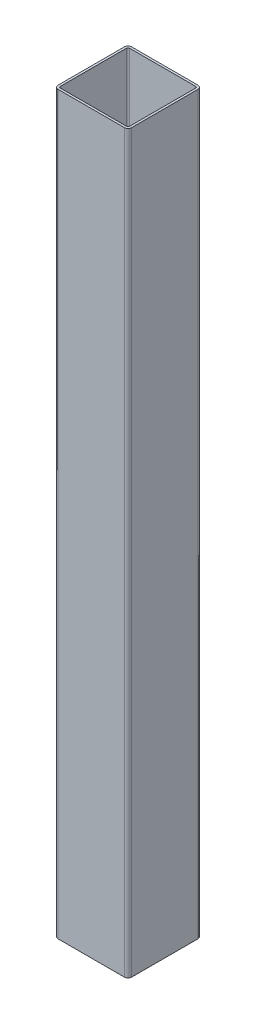
ISO-10303-21;
HEADER;
FILE_DESCRIPTION(('STEP AP214'),'2;1');
FILE_NAME('part.step','',(''),(''),'','','');
FILE_SCHEMA(('AUTOMOTIVE_DESIGN { 1 0 10303 214 1 1 1 1 }'));
ENDSEC;
DATA;
#1=APPLICATION_CONTEXT('core data for automotive mechanical design processes');
#2=APPLICATION_PROTOCOL_DEFINITION('international standard','automotive_design',2000,#1);
#3=PRODUCT_CONTEXT('',#1,'mechanical');
#4=PRODUCT('Part','Part','',(#3));
#5=PRODUCT_RELATED_PRODUCT_CATEGORY('part','',(#4));
#6=PRODUCT_DEFINITION_FORMATION('','',#4);
#7=PRODUCT_DEFINITION_CONTEXT('part definition',#1,'design');
#8=PRODUCT_DEFINITION('design','',#6,#7);
#9=PRODUCT_DEFINITION_SHAPE('','',#8);
#10=(LENGTH_UNIT() NAMED_UNIT(*) SI_UNIT(.MILLI.,.METRE.));
#11=(NAMED_UNIT(*) PLANE_ANGLE_UNIT() SI_UNIT($,.RADIAN.));
#12=(NAMED_UNIT(*) SI_UNIT($,.STERADIAN.) SOLID_ANGLE_UNIT());
#13=UNCERTAINTY_MEASURE_WITH_UNIT(LENGTH_MEASURE(1.E-05),#10,'distance_accuracy_value','');
#14=(GEOMETRIC_REPRESENTATION_CONTEXT(3) GLOBAL_UNCERTAINTY_ASSIGNED_CONTEXT((#13)) GLOBAL_UNIT_ASSIGNED_CONTEXT((#10,
#11,#12)) REPRESENTATION_CONTEXT('',''));
#15=CARTESIAN_POINT('',(0.,0.,0.));
#16=DIRECTION('',(0.,0.,1.));
#17=DIRECTION('',(1.,0.,0.));
#18=AXIS2_PLACEMENT_3D('',#15,#16,#17);
#19=CARTESIAN_POINT('',(45.,1000.,45.));
#20=DIRECTION('',(0.,1.,0.));
#21=DIRECTION('',(0.,0.,1.));
#22=AXIS2_PLACEMENT_3D('',#19,#20,#21);
#23=PLANE('',#22);
#24=CARTESIAN_POINT('',(45.,1000.,45.));
#25=DIRECTION('',(0.,1.,0.));
#26=DIRECTION('',(0.,0.,1.));
#27=AXIS2_PLACEMENT_3D('',#24,#25,#26);
#28=CIRCLE('',#27,5.);
#29=CARTESIAN_POINT('',(45.,1000.,50.));
#30=VERTEX_POINT('',#29);
#31=CARTESIAN_POINT('',(50.,1000.,45.));
#32=VERTEX_POINT('',#31);
#33=EDGE_CURVE('E262',#30,#32,#28,.T.);
#34=ORIENTED_EDGE('',*,*,#33,.T.);
#35=DIRECTION('',(0.,0.,-1.));
#36=VECTOR('',#35,1.);
#37=CARTESIAN_POINT('',(50.,1000.,-45.));
#38=LINE('',#37,#36);
#39=CARTESIAN_POINT('',(50.,1000.,-45.));
#40=VERTEX_POINT('',#39);
#41=EDGE_CURVE('E265',#32,#40,#38,.T.);
#42=ORIENTED_EDGE('',*,*,#41,.T.);
#43=CARTESIAN_POINT('',(45.,1000.,-45.));
#44=DIRECTION('',(0.,1.,0.));
#45=DIRECTION('',(0.,0.,-1.));
#46=AXIS2_PLACEMENT_3D('',#43,#44,#45);
#47=CIRCLE('',#46,5.);
#48=CARTESIAN_POINT('',(45.,1000.,-50.));
#49=VERTEX_POINT('',#48);
#50=EDGE_CURVE('E268',#40,#49,#47,.T.);
#51=ORIENTED_EDGE('',*,*,#50,.T.);
#52=DIRECTION('',(-1.,0.,0.));
#53=VECTOR('',#52,1.);
#54=CARTESIAN_POINT('',(-45.,1000.,-50.));
#55=LINE('',#54,#53);
#56=CARTESIAN_POINT('',(-45.,1000.,-50.));
#57=VERTEX_POINT('',#56);
#58=EDGE_CURVE('E270',#49,#57,#55,.T.);
#59=ORIENTED_EDGE('',*,*,#58,.T.);
#60=CARTESIAN_POINT('',(-45.,1000.,-45.));
#61=DIRECTION('',(0.,1.,0.));
#62=DIRECTION('',(0.,0.,1.));
#63=AXIS2_PLACEMENT_3D('',#60,#61,#62);
#64=CIRCLE('',#63,5.);
#65=CARTESIAN_POINT('',(-50.,1000.,-45.));
#66=VERTEX_POINT('',#65);
#67=EDGE_CURVE('E272',#57,#66,#64,.T.);
#68=ORIENTED_EDGE('',*,*,#67,.T.);
#69=DIRECTION('',(0.,0.,1.));
#70=VECTOR('',#69,1.);
#71=CARTESIAN_POINT('',(-50.,1000.,-45.));
#72=LINE('',#71,#70);
#73=CARTESIAN_POINT('',(-50.,1000.,45.));
#74=VERTEX_POINT('',#73);
#75=EDGE_CURVE('E274',#66,#74,#72,.T.);
#76=ORIENTED_EDGE('',*,*,#75,.T.);
#77=CARTESIAN_POINT('',(-45.,1000.,45.));
#78=DIRECTION('',(0.,1.,0.));
#79=DIRECTION('',(0.,0.,1.));
#80=AXIS2_PLACEMENT_3D('',#77,#78,#79);
#81=CIRCLE('',#80,5.);
#82=CARTESIAN_POINT('',(-45.,1000.,50.));
#83=VERTEX_POINT('',#82);
#84=EDGE_CURVE('E276',#74,#83,#81,.T.);
#85=ORIENTED_EDGE('',*,*,#84,.T.);
#86=DIRECTION('',(1.,0.,0.));
#87=VECTOR('',#86,1.);
#88=CARTESIAN_POINT('',(-45.,1000.,50.));
#89=LINE('',#88,#87);
#90=EDGE_CURVE('E278',#83,#30,#89,.T.);
#91=ORIENTED_EDGE('',*,*,#90,.T.);
#92=EDGE_LOOP('',(#34,#42,#51,#59,#68,#76,#85,#91));
#93=FACE_BOUND('',#92,.T.);
#94=DIRECTION('',(0.,0.,-1.));
#95=VECTOR('',#94,1.);
#96=CARTESIAN_POINT('',(47.,1000.,-45.));
#97=LINE('',#96,#95);
#98=CARTESIAN_POINT('',(47.,1000.,45.));
#99=VERTEX_POINT('',#98);
#100=CARTESIAN_POINT('',(47.,1000.,-45.));
#101=VERTEX_POINT('',#100);
#102=EDGE_CURVE('E205',#99,#101,#97,.T.);
#103=ORIENTED_EDGE('',*,*,#102,.F.);
#104=CARTESIAN_POINT('',(45.,1000.,45.));
#105=DIRECTION('',(0.,1.,0.));
#106=DIRECTION('',(1.,0.,0.));
#107=AXIS2_PLACEMENT_3D('',#104,#105,#106);
#108=CIRCLE('',#107,2.);
#109=CARTESIAN_POINT('',(45.,1000.,47.));
#110=VERTEX_POINT('',#109);
#111=EDGE_CURVE('E197',#110,#99,#108,.T.);
#112=ORIENTED_EDGE('',*,*,#111,.F.);
#113=DIRECTION('',(1.,0.,0.));
#114=VECTOR('',#113,1.);
#115=CARTESIAN_POINT('',(-45.,1000.,47.));
#116=LINE('',#115,#114);
#117=CARTESIAN_POINT('',(-45.,1000.,47.));
#118=VERTEX_POINT('',#117);
#119=EDGE_CURVE('E230',#118,#110,#116,.T.);
#120=ORIENTED_EDGE('',*,*,#119,.F.);
#121=CARTESIAN_POINT('',(-45.,1000.,45.));
#122=DIRECTION('',(0.,1.,0.));
#123=DIRECTION('',(1.,0.,0.));
#124=AXIS2_PLACEMENT_3D('',#121,#122,#123);
#125=CIRCLE('',#124,2.);
#126=CARTESIAN_POINT('',(-47.,1000.,45.));
#127=VERTEX_POINT('',#126);
#128=EDGE_CURVE('E228',#127,#118,#125,.T.);
#129=ORIENTED_EDGE('',*,*,#128,.F.);
#130=DIRECTION('',(0.,0.,1.));
#131=VECTOR('',#130,1.);
#132=CARTESIAN_POINT('',(-47.,1000.,-45.));
#133=LINE('',#132,#131);
#134=CARTESIAN_POINT('',(-47.,1000.,-45.));
#135=VERTEX_POINT('',#134);
#136=EDGE_CURVE('E226',#135,#127,#133,.T.);
#137=ORIENTED_EDGE('',*,*,#136,.F.);
#138=CARTESIAN_POINT('',(-45.,1000.,-45.));
#139=DIRECTION('',(0.,1.,0.));
#140=DIRECTION('',(1.,0.,0.));
#141=AXIS2_PLACEMENT_3D('',#138,#139,#140);
#142=CIRCLE('',#141,2.);
#143=CARTESIAN_POINT('',(-45.,1000.,-47.));
#144=VERTEX_POINT('',#143);
#145=EDGE_CURVE('E224',#144,#135,#142,.T.);
#146=ORIENTED_EDGE('',*,*,#145,.F.);
#147=DIRECTION('',(-1.,0.,0.));
#148=VECTOR('',#147,1.);
#149=CARTESIAN_POINT('',(-45.,1000.,-47.));
#150=LINE('',#149,#148);
#151=CARTESIAN_POINT('',(45.,1000.,-47.));
#152=VERTEX_POINT('',#151);
#153=EDGE_CURVE('E220',#152,#144,#150,.T.);
#154=ORIENTED_EDGE('',*,*,#153,.F.);
#155=CARTESIAN_POINT('',(45.,1000.,-45.));
#156=DIRECTION('',(0.,1.,0.));
#157=DIRECTION('',(1.,0.,0.));
#158=AXIS2_PLACEMENT_3D('',#155,#156,#157);
#159=CIRCLE('',#158,2.);
#160=EDGE_CURVE('E218',#101,#152,#159,.T.);
#161=ORIENTED_EDGE('',*,*,#160,.F.);
#162=EDGE_LOOP('',(#103,#112,#120,#129,#137,#146,#154,#161));
#163=FACE_BOUND('',#162,.T.);
#164=ADVANCED_FACE('F84',(#93,#163),#23,.T.);
#165=CARTESIAN_POINT('',(45.,0.,45.));
#166=DIRECTION('',(0.,1.,0.));
#167=DIRECTION('',(0.,0.,1.));
#168=AXIS2_PLACEMENT_3D('',#165,#166,#167);
#169=PLANE('',#168);
#170=CARTESIAN_POINT('',(45.,0.,45.));
#171=DIRECTION('',(0.,1.,0.));
#172=DIRECTION('',(0.,0.,1.));
#173=AXIS2_PLACEMENT_3D('',#170,#171,#172);
#174=CIRCLE('',#173,5.);
#175=CARTESIAN_POINT('',(45.,0.,50.));
#176=VERTEX_POINT('',#175);
#177=CARTESIAN_POINT('',(50.,0.,45.));
#178=VERTEX_POINT('',#177);
#179=EDGE_CURVE('E213',#176,#178,#174,.T.);
#180=ORIENTED_EDGE('',*,*,#179,.F.);
#181=DIRECTION('',(1.,0.,0.));
#182=VECTOR('',#181,1.);
#183=CARTESIAN_POINT('',(-45.,0.,50.));
#184=LINE('',#183,#182);
#185=CARTESIAN_POINT('',(-45.,0.,50.));
#186=VERTEX_POINT('',#185);
#187=EDGE_CURVE('E266',#186,#176,#184,.T.);
#188=ORIENTED_EDGE('',*,*,#187,.F.);
#189=CARTESIAN_POINT('',(-45.,0.,45.));
#190=DIRECTION('',(0.,1.,0.));
#191=DIRECTION('',(0.,0.,1.));
#192=AXIS2_PLACEMENT_3D('',#189,#190,#191);
#193=CIRCLE('',#192,5.);
#194=CARTESIAN_POINT('',(-50.,0.,45.));
#195=VERTEX_POINT('',#194);
#196=EDGE_CURVE('E293',#195,#186,#193,.T.);
#197=ORIENTED_EDGE('',*,*,#196,.F.);
#198=DIRECTION('',(0.,0.,1.));
#199=VECTOR('',#198,1.);
#200=CARTESIAN_POINT('',(-50.,0.,-45.));
#201=LINE('',#200,#199);
#202=CARTESIAN_POINT('',(-50.,0.,-45.));
#203=VERTEX_POINT('',#202);
#204=EDGE_CURVE('E291',#203,#195,#201,.T.);
#205=ORIENTED_EDGE('',*,*,#204,.F.);
#206=CARTESIAN_POINT('',(-45.,0.,-45.));
#207=DIRECTION('',(0.,1.,0.));
#208=DIRECTION('',(0.,0.,1.));
#209=AXIS2_PLACEMENT_3D('',#206,#207,#208);
#210=CIRCLE('',#209,5.);
#211=CARTESIAN_POINT('',(-45.,0.,-50.));
#212=VERTEX_POINT('',#211);
#213=EDGE_CURVE('E289',#212,#203,#210,.T.);
#214=ORIENTED_EDGE('',*,*,#213,.F.);
#215=DIRECTION('',(-1.,0.,0.));
#216=VECTOR('',#215,1.);
#217=CARTESIAN_POINT('',(-45.,0.,-50.));
#218=LINE('',#217,#216);
#219=CARTESIAN_POINT('',(45.,0.,-50.));
#220=VERTEX_POINT('',#219);
#221=EDGE_CURVE('E287',#220,#212,#218,.T.);
#222=ORIENTED_EDGE('',*,*,#221,.F.);
#223=CARTESIAN_POINT('',(45.,0.,-45.));
#224=DIRECTION('',(0.,1.,0.));
#225=DIRECTION('',(0.,0.,-1.));
#226=AXIS2_PLACEMENT_3D('',#223,#224,#225);
#227=CIRCLE('',#226,5.);
#228=CARTESIAN_POINT('',(50.,0.,-45.));
#229=VERTEX_POINT('',#228);
#230=EDGE_CURVE('E285',#229,#220,#227,.T.);
#231=ORIENTED_EDGE('',*,*,#230,.F.);
#232=DIRECTION('',(0.,0.,-1.));
#233=VECTOR('',#232,1.);
#234=CARTESIAN_POINT('',(50.,0.,-45.));
#235=LINE('',#234,#233);
#236=EDGE_CURVE('E283',#178,#229,#235,.T.);
#237=ORIENTED_EDGE('',*,*,#236,.F.);
#238=EDGE_LOOP('',(#180,#188,#197,#205,#214,#222,#231,#237));
#239=FACE_BOUND('',#238,.T.);
#240=CARTESIAN_POINT('',(45.,0.,45.));
#241=DIRECTION('',(0.,1.,0.));
#242=DIRECTION('',(1.,0.,0.));
#243=AXIS2_PLACEMENT_3D('',#240,#241,#242);
#244=CIRCLE('',#243,2.);
#245=CARTESIAN_POINT('',(45.,0.,47.));
#246=VERTEX_POINT('',#245);
#247=CARTESIAN_POINT('',(47.,0.,45.));
#248=VERTEX_POINT('',#247);
#249=EDGE_CURVE('E107',#246,#248,#244,.T.);
#250=ORIENTED_EDGE('',*,*,#249,.T.);
#251=DIRECTION('',(0.,0.,-1.));
#252=VECTOR('',#251,1.);
#253=CARTESIAN_POINT('',(47.,0.,-45.));
#254=LINE('',#253,#252);
#255=CARTESIAN_POINT('',(47.,0.,-45.));
#256=VERTEX_POINT('',#255);
#257=EDGE_CURVE('E212',#248,#256,#254,.T.);
#258=ORIENTED_EDGE('',*,*,#257,.T.);
#259=CARTESIAN_POINT('',(45.,0.,-45.));
#260=DIRECTION('',(0.,1.,0.));
#261=DIRECTION('',(1.,0.,0.));
#262=AXIS2_PLACEMENT_3D('',#259,#260,#261);
#263=CIRCLE('',#262,2.);
#264=CARTESIAN_POINT('',(45.,0.,-47.));
#265=VERTEX_POINT('',#264);
#266=EDGE_CURVE('E234',#256,#265,#263,.T.);
#267=ORIENTED_EDGE('',*,*,#266,.T.);
#268=DIRECTION('',(-1.,0.,0.));
#269=VECTOR('',#268,1.);
#270=CARTESIAN_POINT('',(-45.,0.,-47.));
#271=LINE('',#270,#269);
#272=CARTESIAN_POINT('',(-45.,0.,-47.));
#273=VERTEX_POINT('',#272);
#274=EDGE_CURVE('E237',#265,#273,#271,.T.);
#275=ORIENTED_EDGE('',*,*,#274,.T.);
#276=CARTESIAN_POINT('',(-45.,0.,-45.));
#277=DIRECTION('',(0.,1.,0.));
#278=DIRECTION('',(1.,0.,0.));
#279=AXIS2_PLACEMENT_3D('',#276,#277,#278);
#280=CIRCLE('',#279,2.);
#281=CARTESIAN_POINT('',(-47.,0.,-45.));
#282=VERTEX_POINT('',#281);
#283=EDGE_CURVE('E240',#273,#282,#280,.T.);
#284=ORIENTED_EDGE('',*,*,#283,.T.);
#285=DIRECTION('',(0.,0.,1.));
#286=VECTOR('',#285,1.);
#287=CARTESIAN_POINT('',(-47.,0.,-45.));
#288=LINE('',#287,#286);
#289=CARTESIAN_POINT('',(-47.,0.,45.));
#290=VERTEX_POINT('',#289);
#291=EDGE_CURVE('E243',#282,#290,#288,.T.);
#292=ORIENTED_EDGE('',*,*,#291,.T.);
#293=CARTESIAN_POINT('',(-45.,0.,45.));
#294=DIRECTION('',(0.,1.,0.));
#295=DIRECTION('',(1.,0.,0.));
#296=AXIS2_PLACEMENT_3D('',#293,#294,#295);
#297=CIRCLE('',#296,2.);
#298=CARTESIAN_POINT('',(-45.,0.,47.));
#299=VERTEX_POINT('',#298);
#300=EDGE_CURVE('E246',#290,#299,#297,.T.);
#301=ORIENTED_EDGE('',*,*,#300,.T.);
#302=DIRECTION('',(1.,0.,0.));
#303=VECTOR('',#302,1.);
#304=CARTESIAN_POINT('',(-45.,0.,47.));
#305=LINE('',#304,#303);
#306=EDGE_CURVE('E206',#299,#246,#305,.T.);
#307=ORIENTED_EDGE('',*,*,#306,.T.);
#308=EDGE_LOOP('',(#250,#258,#267,#275,#284,#292,#301,#307));
#309=FACE_BOUND('',#308,.T.);
#310=ADVANCED_FACE('F323',(#239,#309),#169,.F.);
#311=CARTESIAN_POINT('',(45.,1000.,45.));
#312=DIRECTION('',(0.,-1.,0.));
#313=DIRECTION('',(0.,0.,-1.));
#314=AXIS2_PLACEMENT_3D('',#311,#312,#313);
#315=CYLINDRICAL_SURFACE('',#314,5.);
#316=ORIENTED_EDGE('',*,*,#179,.T.);
#317=DIRECTION('',(0.,-1.,0.));
#318=VECTOR('',#317,1.);
#319=CARTESIAN_POINT('',(50.,1000.,45.));
#320=LINE('',#319,#318);
#321=EDGE_CURVE('E12',#32,#178,#320,.T.);
#322=ORIENTED_EDGE('',*,*,#321,.F.);
#323=ORIENTED_EDGE('',*,*,#33,.F.);
#324=DIRECTION('',(0.,-1.,0.));
#325=VECTOR('',#324,1.);
#326=CARTESIAN_POINT('',(45.,1000.,50.));
#327=LINE('',#326,#325);
#328=EDGE_CURVE('E280',#30,#176,#327,.T.);
#329=ORIENTED_EDGE('',*,*,#328,.T.);
#330=EDGE_LOOP('',(#316,#322,#323,#329));
#331=FACE_BOUND('',#330,.T.);
#332=ADVANCED_FACE('F86',(#331),#315,.T.);
#333=CARTESIAN_POINT('',(50.,1000.,-45.));
#334=DIRECTION('',(-1.,0.,0.));
#335=DIRECTION('',(0.,0.,1.));
#336=AXIS2_PLACEMENT_3D('',#333,#334,#335);
#337=PLANE('',#336);
#338=ORIENTED_EDGE('',*,*,#236,.T.);
#339=DIRECTION('',(0.,-1.,0.));
#340=VECTOR('',#339,1.);
#341=CARTESIAN_POINT('',(50.,1000.,-45.));
#342=LINE('',#341,#340);
#343=EDGE_CURVE('E92',#40,#229,#342,.T.);
#344=ORIENTED_EDGE('',*,*,#343,.F.);
#345=ORIENTED_EDGE('',*,*,#41,.F.);
#346=ORIENTED_EDGE('',*,*,#321,.T.);
#347=EDGE_LOOP('',(#338,#344,#345,#346));
#348=FACE_BOUND('',#347,.T.);
#349=ADVANCED_FACE('F340',(#348),#337,.F.);
#350=CARTESIAN_POINT('',(45.,1000.,-45.));
#351=DIRECTION('',(0.,-1.,0.));
#352=DIRECTION('',(0.,0.,-1.));
#353=AXIS2_PLACEMENT_3D('',#350,#351,#352);
#354=CYLINDRICAL_SURFACE('',#353,5.);
#355=ORIENTED_EDGE('',*,*,#230,.T.);
#356=DIRECTION('',(0.,-1.,0.));
#357=VECTOR('',#356,1.);
#358=CARTESIAN_POINT('',(45.,1000.,-50.));
#359=LINE('',#358,#357);
#360=EDGE_CURVE('E310',#49,#220,#359,.T.);
#361=ORIENTED_EDGE('',*,*,#360,.F.);
#362=ORIENTED_EDGE('',*,*,#50,.F.);
#363=ORIENTED_EDGE('',*,*,#343,.T.);
#364=EDGE_LOOP('',(#355,#361,#362,#363));
#365=FACE_BOUND('',#364,.T.);
#366=ADVANCED_FACE('F317',(#365),#354,.T.);
#367=CARTESIAN_POINT('',(-45.,1000.,-50.));
#368=DIRECTION('',(0.,0.,1.));
#369=DIRECTION('',(1.,0.,0.));
#370=AXIS2_PLACEMENT_3D('',#367,#368,#369);
#371=PLANE('',#370);
#372=ORIENTED_EDGE('',*,*,#221,.T.);
#373=DIRECTION('',(0.,-1.,0.));
#374=VECTOR('',#373,1.);
#375=CARTESIAN_POINT('',(-45.,1000.,-50.));
#376=LINE('',#375,#374);
#377=EDGE_CURVE('E307',#57,#212,#376,.T.);
#378=ORIENTED_EDGE('',*,*,#377,.F.);
#379=ORIENTED_EDGE('',*,*,#58,.F.);
#380=ORIENTED_EDGE('',*,*,#360,.T.);
#381=EDGE_LOOP('',(#372,#378,#379,#380));
#382=FACE_BOUND('',#381,.T.);
#383=ADVANCED_FACE('F329',(#382),#371,.F.);
#384=CARTESIAN_POINT('',(-45.,1000.,-45.));
#385=DIRECTION('',(0.,-1.,0.));
#386=DIRECTION('',(0.,0.,-1.));
#387=AXIS2_PLACEMENT_3D('',#384,#385,#386);
#388=CYLINDRICAL_SURFACE('',#387,5.);
#389=ORIENTED_EDGE('',*,*,#213,.T.);
#390=DIRECTION('',(0.,-1.,0.));
#391=VECTOR('',#390,1.);
#392=CARTESIAN_POINT('',(-50.,1000.,-45.));
#393=LINE('',#392,#391);
#394=EDGE_CURVE('E304',#66,#203,#393,.T.);
#395=ORIENTED_EDGE('',*,*,#394,.F.);
#396=ORIENTED_EDGE('',*,*,#67,.F.);
#397=ORIENTED_EDGE('',*,*,#377,.T.);
#398=EDGE_LOOP('',(#389,#395,#396,#397));
#399=FACE_BOUND('',#398,.T.);
#400=ADVANCED_FACE('F333',(#399),#388,.T.);
#401=CARTESIAN_POINT('',(-50.,1000.,-45.));
#402=DIRECTION('',(1.,0.,0.));
#403=DIRECTION('',(0.,0.,-1.));
#404=AXIS2_PLACEMENT_3D('',#401,#402,#403);
#405=PLANE('',#404);
#406=ORIENTED_EDGE('',*,*,#204,.T.);
#407=DIRECTION('',(0.,-1.,0.));
#408=VECTOR('',#407,1.);
#409=CARTESIAN_POINT('',(-50.,1000.,45.));
#410=LINE('',#409,#408);
#411=EDGE_CURVE('E301',#74,#195,#410,.T.);
#412=ORIENTED_EDGE('',*,*,#411,.F.);
#413=ORIENTED_EDGE('',*,*,#75,.F.);
#414=ORIENTED_EDGE('',*,*,#394,.T.);
#415=EDGE_LOOP('',(#406,#412,#413,#414));
#416=FACE_BOUND('',#415,.T.);
#417=ADVANCED_FACE('F353',(#416),#405,.F.);
#418=CARTESIAN_POINT('',(-45.,1000.,45.));
#419=DIRECTION('',(0.,-1.,0.));
#420=DIRECTION('',(0.,0.,-1.));
#421=AXIS2_PLACEMENT_3D('',#418,#419,#420);
#422=CYLINDRICAL_SURFACE('',#421,5.);
#423=ORIENTED_EDGE('',*,*,#196,.T.);
#424=DIRECTION('',(0.,-1.,0.));
#425=VECTOR('',#424,1.);
#426=CARTESIAN_POINT('',(-45.,1000.,50.));
#427=LINE('',#426,#425);
#428=EDGE_CURVE('E298',#83,#186,#427,.T.);
#429=ORIENTED_EDGE('',*,*,#428,.F.);
#430=ORIENTED_EDGE('',*,*,#84,.F.);
#431=ORIENTED_EDGE('',*,*,#411,.T.);
#432=EDGE_LOOP('',(#423,#429,#430,#431));
#433=FACE_BOUND('',#432,.T.);
#434=ADVANCED_FACE('F351',(#433),#422,.T.);
#435=CARTESIAN_POINT('',(-45.,1000.,50.));
#436=DIRECTION('',(0.,0.,-1.));
#437=DIRECTION('',(-1.,0.,0.));
#438=AXIS2_PLACEMENT_3D('',#435,#436,#437);
#439=PLANE('',#438);
#440=ORIENTED_EDGE('',*,*,#187,.T.);
#441=ORIENTED_EDGE('',*,*,#328,.F.);
#442=ORIENTED_EDGE('',*,*,#90,.F.);
#443=ORIENTED_EDGE('',*,*,#428,.T.);
#444=EDGE_LOOP('',(#440,#441,#442,#443));
#445=FACE_BOUND('',#444,.T.);
#446=ADVANCED_FACE('F346',(#445),#439,.F.);
#447=CARTESIAN_POINT('',(45.,1000.,45.));
#448=DIRECTION('',(0.,-1.,0.));
#449=DIRECTION('',(0.,0.,-1.));
#450=AXIS2_PLACEMENT_3D('',#447,#448,#449);
#451=CYLINDRICAL_SURFACE('',#450,2.);
#452=ORIENTED_EDGE('',*,*,#249,.F.);
#453=DIRECTION('',(0.,-1.,0.));
#454=VECTOR('',#453,1.);
#455=CARTESIAN_POINT('',(45.,1000.,47.));
#456=LINE('',#455,#454);
#457=EDGE_CURVE('E201',#110,#246,#456,.T.);
#458=ORIENTED_EDGE('',*,*,#457,.F.);
#459=ORIENTED_EDGE('',*,*,#111,.T.);
#460=DIRECTION('',(0.,-1.,0.));
#461=VECTOR('',#460,1.);
#462=CARTESIAN_POINT('',(47.,1000.,45.));
#463=LINE('',#462,#461);
#464=EDGE_CURVE('E200',#99,#248,#463,.T.);
#465=ORIENTED_EDGE('',*,*,#464,.T.);
#466=EDGE_LOOP('',(#452,#458,#459,#465));
#467=FACE_BOUND('',#466,.T.);
#468=ADVANCED_FACE('F199',(#467),#451,.F.);
#469=CARTESIAN_POINT('',(47.,1000.,-45.));
#470=DIRECTION('',(-1.,0.,0.));
#471=DIRECTION('',(0.,0.,1.));
#472=AXIS2_PLACEMENT_3D('',#469,#470,#471);
#473=PLANE('',#472);
#474=ORIENTED_EDGE('',*,*,#257,.F.);
#475=ORIENTED_EDGE('',*,*,#464,.F.);
#476=ORIENTED_EDGE('',*,*,#102,.T.);
#477=DIRECTION('',(0.,-1.,0.));
#478=VECTOR('',#477,1.);
#479=CARTESIAN_POINT('',(47.,1000.,-45.));
#480=LINE('',#479,#478);
#481=EDGE_CURVE('E214',#101,#256,#480,.T.);
#482=ORIENTED_EDGE('',*,*,#481,.T.);
#483=EDGE_LOOP('',(#474,#475,#476,#482));
#484=FACE_BOUND('',#483,.T.);
#485=ADVANCED_FACE('F209',(#484),#473,.T.);
#486=CARTESIAN_POINT('',(45.,1000.,-45.));
#487=DIRECTION('',(0.,-1.,0.));
#488=DIRECTION('',(0.,0.,-1.));
#489=AXIS2_PLACEMENT_3D('',#486,#487,#488);
#490=CYLINDRICAL_SURFACE('',#489,2.);
#491=ORIENTED_EDGE('',*,*,#266,.F.);
#492=ORIENTED_EDGE('',*,*,#481,.F.);
#493=ORIENTED_EDGE('',*,*,#160,.T.);
#494=DIRECTION('',(0.,-1.,0.));
#495=VECTOR('',#494,1.);
#496=CARTESIAN_POINT('',(45.,1000.,-47.));
#497=LINE('',#496,#495);
#498=EDGE_CURVE('E259',#152,#265,#497,.T.);
#499=ORIENTED_EDGE('',*,*,#498,.T.);
#500=EDGE_LOOP('',(#491,#492,#493,#499));
#501=FACE_BOUND('',#500,.T.);
#502=ADVANCED_FACE('F378',(#501),#490,.F.);
#503=CARTESIAN_POINT('',(-45.,1000.,-47.));
#504=DIRECTION('',(0.,0.,1.));
#505=DIRECTION('',(1.,0.,0.));
#506=AXIS2_PLACEMENT_3D('',#503,#504,#505);
#507=PLANE('',#506);
#508=ORIENTED_EDGE('',*,*,#274,.F.);
#509=ORIENTED_EDGE('',*,*,#498,.F.);
#510=ORIENTED_EDGE('',*,*,#153,.T.);
#511=DIRECTION('',(0.,-1.,0.));
#512=VECTOR('',#511,1.);
#513=CARTESIAN_POINT('',(-45.,1000.,-47.));
#514=LINE('',#513,#512);
#515=EDGE_CURVE('E257',#144,#273,#514,.T.);
#516=ORIENTED_EDGE('',*,*,#515,.T.);
#517=EDGE_LOOP('',(#508,#509,#510,#516));
#518=FACE_BOUND('',#517,.T.);
#519=ADVANCED_FACE('F382',(#518),#507,.T.);
#520=CARTESIAN_POINT('',(-45.,1000.,-45.));
#521=DIRECTION('',(0.,-1.,0.));
#522=DIRECTION('',(0.,0.,-1.));
#523=AXIS2_PLACEMENT_3D('',#520,#521,#522);
#524=CYLINDRICAL_SURFACE('',#523,2.);
#525=ORIENTED_EDGE('',*,*,#283,.F.);
#526=ORIENTED_EDGE('',*,*,#515,.F.);
#527=ORIENTED_EDGE('',*,*,#145,.T.);
#528=DIRECTION('',(0.,-1.,0.));
#529=VECTOR('',#528,1.);
#530=CARTESIAN_POINT('',(-47.,1000.,-45.));
#531=LINE('',#530,#529);
#532=EDGE_CURVE('E255',#135,#282,#531,.T.);
#533=ORIENTED_EDGE('',*,*,#532,.T.);
#534=EDGE_LOOP('',(#525,#526,#527,#533));
#535=FACE_BOUND('',#534,.T.);
#536=ADVANCED_FACE('F388',(#535),#524,.F.);
#537=CARTESIAN_POINT('',(-47.,1000.,-45.));
#538=DIRECTION('',(1.,0.,0.));
#539=DIRECTION('',(0.,0.,-1.));
#540=AXIS2_PLACEMENT_3D('',#537,#538,#539);
#541=PLANE('',#540);
#542=ORIENTED_EDGE('',*,*,#291,.F.);
#543=ORIENTED_EDGE('',*,*,#532,.F.);
#544=ORIENTED_EDGE('',*,*,#136,.T.);
#545=DIRECTION('',(0.,-1.,0.));
#546=VECTOR('',#545,1.);
#547=CARTESIAN_POINT('',(-47.,1000.,45.));
#548=LINE('',#547,#546);
#549=EDGE_CURVE('E253',#127,#290,#548,.T.);
#550=ORIENTED_EDGE('',*,*,#549,.T.);
#551=EDGE_LOOP('',(#542,#543,#544,#550));
#552=FACE_BOUND('',#551,.T.);
#553=ADVANCED_FACE('F392',(#552),#541,.T.);
#554=CARTESIAN_POINT('',(-45.,1000.,45.));
#555=DIRECTION('',(0.,-1.,0.));
#556=DIRECTION('',(0.,0.,-1.));
#557=AXIS2_PLACEMENT_3D('',#554,#555,#556);
#558=CYLINDRICAL_SURFACE('',#557,2.);
#559=ORIENTED_EDGE('',*,*,#300,.F.);
#560=ORIENTED_EDGE('',*,*,#549,.F.);
#561=ORIENTED_EDGE('',*,*,#128,.T.);
#562=DIRECTION('',(0.,-1.,0.));
#563=VECTOR('',#562,1.);
#564=CARTESIAN_POINT('',(-45.,1000.,47.));
#565=LINE('',#564,#563);
#566=EDGE_CURVE('E99',#118,#299,#565,.T.);
#567=ORIENTED_EDGE('',*,*,#566,.T.);
#568=EDGE_LOOP('',(#559,#560,#561,#567));
#569=FACE_BOUND('',#568,.T.);
#570=ADVANCED_FACE('F396',(#569),#558,.F.);
#571=CARTESIAN_POINT('',(-45.,1000.,47.));
#572=DIRECTION('',(0.,0.,-1.));
#573=DIRECTION('',(-1.,0.,0.));
#574=AXIS2_PLACEMENT_3D('',#571,#572,#573);
#575=PLANE('',#574);
#576=ORIENTED_EDGE('',*,*,#306,.F.);
#577=ORIENTED_EDGE('',*,*,#566,.F.);
#578=ORIENTED_EDGE('',*,*,#119,.T.);
#579=ORIENTED_EDGE('',*,*,#457,.T.);
#580=EDGE_LOOP('',(#576,#577,#578,#579));
#581=FACE_BOUND('',#580,.T.);
#582=ADVANCED_FACE('F400',(#581),#575,.T.);
#583=CLOSED_SHELL('',(#164,#310,#332,#349,#366,#383,#400,#417,#434,#446,#468,#485,#502,#519,
#536,#553,#570,#582));
#584=MANIFOLD_SOLID_BREP('B2',#583);
#585=ADVANCED_BREP_SHAPE_REPRESENTATION('',(#18,#584),#14);
#586=SHAPE_DEFINITION_REPRESENTATION(#9,#585);
ENDSEC;
END-ISO-10303-21;
